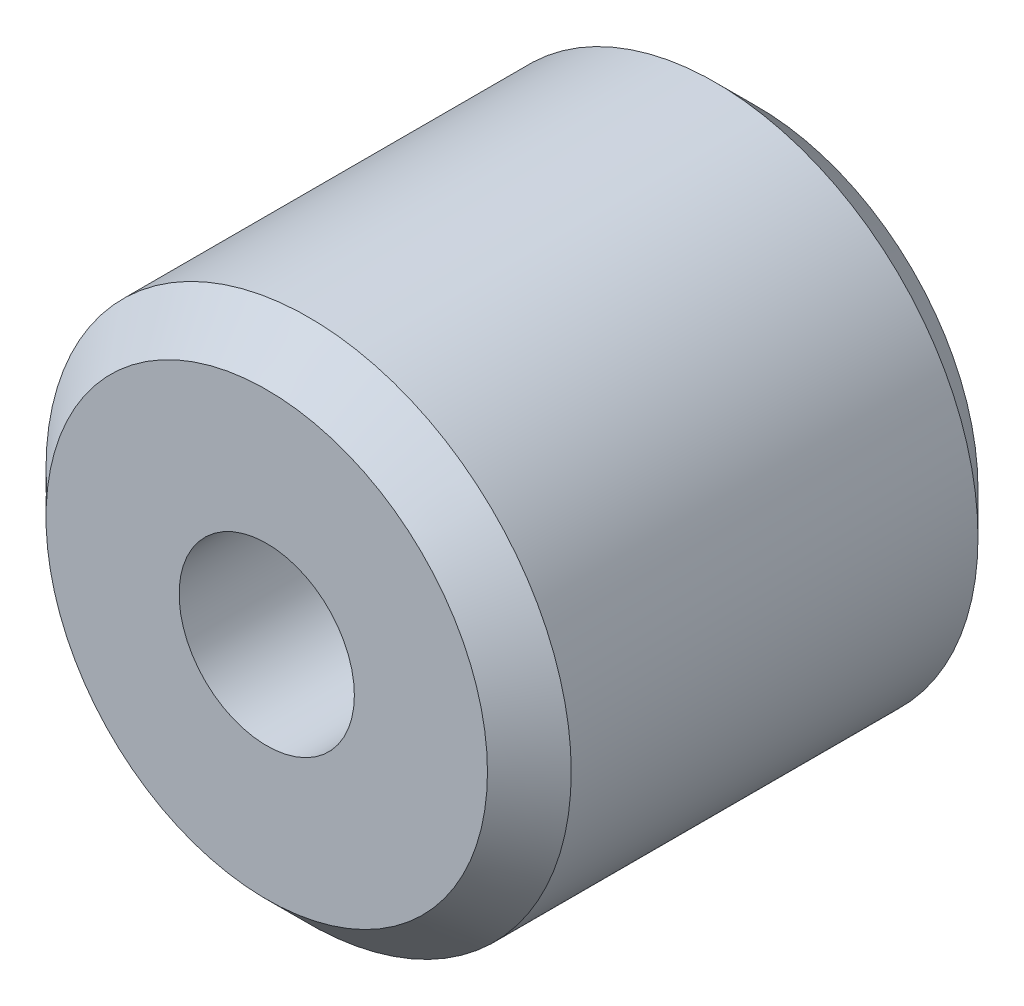
ISO-10303-21;
HEADER;
FILE_DESCRIPTION(('STEP AP214'),'2;1');
FILE_NAME('part.step','',(''),(''),'','','');
FILE_SCHEMA(('AUTOMOTIVE_DESIGN { 1 0 10303 214 1 1 1 1 }'));
ENDSEC;
DATA;
#1=APPLICATION_CONTEXT('core data for automotive mechanical design processes');
#2=APPLICATION_PROTOCOL_DEFINITION('international standard','automotive_design',2000,#1);
#3=PRODUCT_CONTEXT('',#1,'mechanical');
#4=PRODUCT('Part','Part','',(#3));
#5=PRODUCT_RELATED_PRODUCT_CATEGORY('part','',(#4));
#6=PRODUCT_DEFINITION_FORMATION('','',#4);
#7=PRODUCT_DEFINITION_CONTEXT('part definition',#1,'design');
#8=PRODUCT_DEFINITION('design','',#6,#7);
#9=PRODUCT_DEFINITION_SHAPE('','',#8);
#10=(LENGTH_UNIT() NAMED_UNIT(*) SI_UNIT(.MILLI.,.METRE.));
#11=(NAMED_UNIT(*) PLANE_ANGLE_UNIT() SI_UNIT($,.RADIAN.));
#12=(NAMED_UNIT(*) SI_UNIT($,.STERADIAN.) SOLID_ANGLE_UNIT());
#13=UNCERTAINTY_MEASURE_WITH_UNIT(LENGTH_MEASURE(1.E-05),#10,'distance_accuracy_value','');
#14=(GEOMETRIC_REPRESENTATION_CONTEXT(3) GLOBAL_UNCERTAINTY_ASSIGNED_CONTEXT((#13)) GLOBAL_UNIT_ASSIGNED_CONTEXT((#10,
#11,#12)) REPRESENTATION_CONTEXT('',''));
#15=CARTESIAN_POINT('',(0.,0.,0.));
#16=DIRECTION('',(0.,0.,1.));
#17=DIRECTION('',(1.,0.,0.));
#18=AXIS2_PLACEMENT_3D('',#15,#16,#17);
#19=CARTESIAN_POINT('',(0.,0.,12.5006485355649));
#20=DIRECTION('',(0.,0.,1.));
#21=DIRECTION('',(1.,0.,0.));
#22=AXIS2_PLACEMENT_3D('',#19,#20,#21);
#23=CYLINDRICAL_SURFACE('',#22,4.765);
#24=CARTESIAN_POINT('',(0.,0.,3.68999999999999));
#25=DIRECTION('',(0.,0.,1.));
#26=DIRECTION('',(1.,0.,0.));
#27=AXIS2_PLACEMENT_3D('',#24,#25,#26);
#28=CIRCLE('',#27,4.765);
#29=CARTESIAN_POINT('',(4.765,0.,3.68999999999999));
#30=VERTEX_POINT('',#29);
#31=EDGE_CURVE('E10',#30,#30,#28,.T.);
#32=ORIENTED_EDGE('',*,*,#31,.F.);
#33=EDGE_LOOP('',(#32));
#34=FACE_BOUND('',#33,.T.);
#35=CARTESIAN_POINT('',(0.,0.,-3.68999999999999));
#36=DIRECTION('',(0.,0.,1.));
#37=DIRECTION('',(1.,0.,0.));
#38=AXIS2_PLACEMENT_3D('',#35,#36,#37);
#39=CIRCLE('',#38,4.765);
#40=CARTESIAN_POINT('',(4.765,0.,-3.68999999999999));
#41=VERTEX_POINT('',#40);
#42=EDGE_CURVE('E57',#41,#41,#39,.T.);
#43=ORIENTED_EDGE('',*,*,#42,.T.);
#44=EDGE_LOOP('',(#43));
#45=FACE_BOUND('',#44,.T.);
#46=ADVANCED_FACE('F35',(#34,#45),#23,.T.);
#47=CARTESIAN_POINT('',(0.,0.,3.68999999999999));
#48=DIRECTION('',(0.,0.,-1.));
#49=DIRECTION('',(-1.,0.,0.));
#50=AXIS2_PLACEMENT_3D('',#47,#48,#49);
#51=CONICAL_SURFACE('',#50,4.765,0.785398163397444);
#52=CARTESIAN_POINT('',(0.,0.,4.45));
#53=DIRECTION('',(0.,0.,1.));
#54=DIRECTION('',(1.,0.,0.));
#55=AXIS2_PLACEMENT_3D('',#52,#53,#54);
#56=CIRCLE('',#55,4.00499999999999);
#57=CARTESIAN_POINT('',(4.00499999999999,0.,4.45));
#58=VERTEX_POINT('',#57);
#59=EDGE_CURVE('E41',#58,#58,#56,.T.);
#60=ORIENTED_EDGE('',*,*,#59,.F.);
#61=EDGE_LOOP('',(#60));
#62=FACE_BOUND('',#61,.T.);
#63=ORIENTED_EDGE('',*,*,#31,.T.);
#64=EDGE_LOOP('',(#63));
#65=FACE_BOUND('',#64,.T.);
#66=ADVANCED_FACE('F82',(#62,#65),#51,.T.);
#67=CARTESIAN_POINT('',(0.,4.00499999999999,4.45));
#68=DIRECTION('',(0.,0.,-1.));
#69=DIRECTION('',(-1.,0.,0.));
#70=AXIS2_PLACEMENT_3D('',#67,#68,#69);
#71=PLANE('',#70);
#72=CARTESIAN_POINT('',(0.,0.,4.45));
#73=DIRECTION('',(0.,0.,1.));
#74=DIRECTION('',(1.,0.,0.));
#75=AXIS2_PLACEMENT_3D('',#72,#73,#74);
#76=CIRCLE('',#75,1.59);
#77=CARTESIAN_POINT('',(1.59,0.,4.45));
#78=VERTEX_POINT('',#77);
#79=EDGE_CURVE('E45',#78,#78,#76,.T.);
#80=ORIENTED_EDGE('',*,*,#79,.F.);
#81=EDGE_LOOP('',(#80));
#82=FACE_BOUND('',#81,.T.);
#83=ORIENTED_EDGE('',*,*,#59,.T.);
#84=EDGE_LOOP('',(#83));
#85=FACE_BOUND('',#84,.T.);
#86=ADVANCED_FACE('F77',(#82,#85),#71,.F.);
#87=CARTESIAN_POINT('',(0.,0.,12.5006485355649));
#88=DIRECTION('',(0.,0.,1.));
#89=DIRECTION('',(1.,0.,0.));
#90=AXIS2_PLACEMENT_3D('',#87,#88,#89);
#91=CYLINDRICAL_SURFACE('',#90,1.59);
#92=CARTESIAN_POINT('',(0.,0.,-4.45));
#93=DIRECTION('',(0.,0.,1.));
#94=DIRECTION('',(1.,0.,0.));
#95=AXIS2_PLACEMENT_3D('',#92,#93,#94);
#96=CIRCLE('',#95,1.59);
#97=CARTESIAN_POINT('',(1.59,0.,-4.45));
#98=VERTEX_POINT('',#97);
#99=EDGE_CURVE('E49',#98,#98,#96,.T.);
#100=ORIENTED_EDGE('',*,*,#99,.F.);
#101=EDGE_LOOP('',(#100));
#102=FACE_BOUND('',#101,.T.);
#103=ORIENTED_EDGE('',*,*,#79,.T.);
#104=EDGE_LOOP('',(#103));
#105=FACE_BOUND('',#104,.T.);
#106=ADVANCED_FACE('F71',(#102,#105),#91,.F.);
#107=CARTESIAN_POINT('',(0.,1.59,-4.45));
#108=DIRECTION('',(0.,0.,1.));
#109=DIRECTION('',(1.,0.,0.));
#110=AXIS2_PLACEMENT_3D('',#107,#108,#109);
#111=PLANE('',#110);
#112=CARTESIAN_POINT('',(0.,0.,-4.45));
#113=DIRECTION('',(0.,0.,1.));
#114=DIRECTION('',(1.,0.,0.));
#115=AXIS2_PLACEMENT_3D('',#112,#113,#114);
#116=CIRCLE('',#115,4.005);
#117=CARTESIAN_POINT('',(4.005,0.,-4.45));
#118=VERTEX_POINT('',#117);
#119=EDGE_CURVE('E54',#118,#118,#116,.T.);
#120=ORIENTED_EDGE('',*,*,#119,.F.);
#121=EDGE_LOOP('',(#120));
#122=FACE_BOUND('',#121,.T.);
#123=ORIENTED_EDGE('',*,*,#99,.T.);
#124=EDGE_LOOP('',(#123));
#125=FACE_BOUND('',#124,.T.);
#126=ADVANCED_FACE('F65',(#122,#125),#111,.F.);
#127=CARTESIAN_POINT('',(0.,0.,-4.45));
#128=DIRECTION('',(0.,0.,1.));
#129=DIRECTION('',(1.,0.,0.));
#130=AXIS2_PLACEMENT_3D('',#127,#128,#129);
#131=CONICAL_SURFACE('',#130,4.005,0.785398163397442);
#132=ORIENTED_EDGE('',*,*,#42,.F.);
#133=EDGE_LOOP('',(#132));
#134=FACE_BOUND('',#133,.T.);
#135=ORIENTED_EDGE('',*,*,#119,.T.);
#136=EDGE_LOOP('',(#135));
#137=FACE_BOUND('',#136,.T.);
#138=ADVANCED_FACE('F62',(#134,#137),#131,.T.);
#139=CLOSED_SHELL('',(#46,#66,#86,#106,#126,#138));
#140=MANIFOLD_SOLID_BREP('B2',#139);
#141=ADVANCED_BREP_SHAPE_REPRESENTATION('',(#18,#140),#14);
#142=SHAPE_DEFINITION_REPRESENTATION(#9,#141);
ENDSEC;
END-ISO-10303-21;
